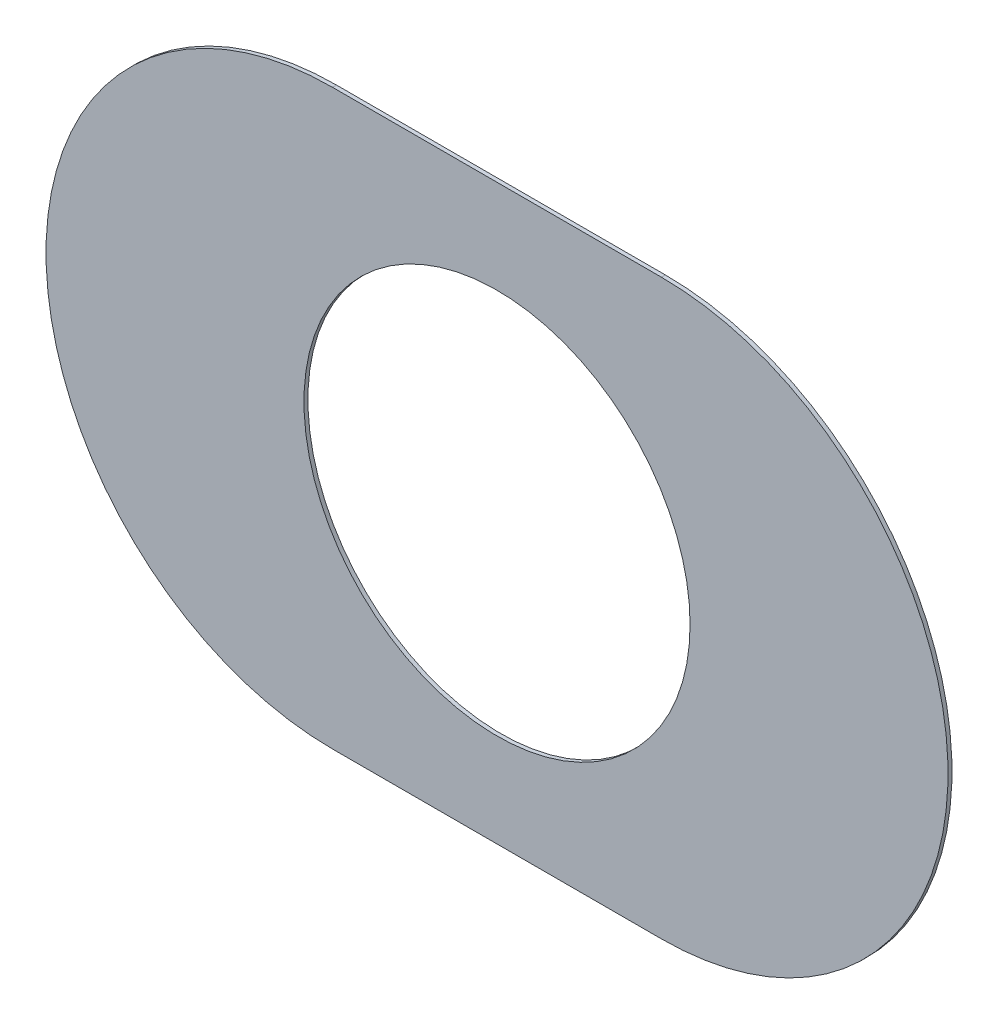
ISO-10303-21;
HEADER;
FILE_DESCRIPTION(('STEP AP214'),'2;1');
FILE_NAME('part.step','',(''),(''),'','','');
FILE_SCHEMA(('AUTOMOTIVE_DESIGN { 1 0 10303 214 1 1 1 1 }'));
ENDSEC;
DATA;
#1=APPLICATION_CONTEXT('core data for automotive mechanical design processes');
#2=APPLICATION_PROTOCOL_DEFINITION('international standard','automotive_design',2000,#1);
#3=PRODUCT_CONTEXT('',#1,'mechanical');
#4=PRODUCT('Part','Part','',(#3));
#5=PRODUCT_RELATED_PRODUCT_CATEGORY('part','',(#4));
#6=PRODUCT_DEFINITION_FORMATION('','',#4);
#7=PRODUCT_DEFINITION_CONTEXT('part definition',#1,'design');
#8=PRODUCT_DEFINITION('design','',#6,#7);
#9=PRODUCT_DEFINITION_SHAPE('','',#8);
#10=(LENGTH_UNIT() NAMED_UNIT(*) SI_UNIT(.MILLI.,.METRE.));
#11=(NAMED_UNIT(*) PLANE_ANGLE_UNIT() SI_UNIT($,.RADIAN.));
#12=(NAMED_UNIT(*) SI_UNIT($,.STERADIAN.) SOLID_ANGLE_UNIT());
#13=UNCERTAINTY_MEASURE_WITH_UNIT(LENGTH_MEASURE(1.E-05),#10,'distance_accuracy_value','');
#14=(GEOMETRIC_REPRESENTATION_CONTEXT(3) GLOBAL_UNCERTAINTY_ASSIGNED_CONTEXT((#13)) GLOBAL_UNIT_ASSIGNED_CONTEXT((#10,
#11,#12)) REPRESENTATION_CONTEXT('',''));
#15=CARTESIAN_POINT('',(0.,0.,0.));
#16=DIRECTION('',(0.,0.,1.));
#17=DIRECTION('',(1.,0.,0.));
#18=AXIS2_PLACEMENT_3D('',#15,#16,#17);
#19=CARTESIAN_POINT('',(24.3000003427268,17.0800006854535,0.));
#20=DIRECTION('',(0.,0.,1.));
#21=DIRECTION('',(1.,0.,0.));
#22=AXIS2_PLACEMENT_3D('',#19,#20,#21);
#23=PLANE('',#22);
#24=CARTESIAN_POINT('',(24.3000003427268,17.0800006854535,0.));
#25=DIRECTION('',(0.,0.,-1.));
#26=DIRECTION('',(-1.,0.,0.));
#27=AXIS2_PLACEMENT_3D('',#24,#25,#26);
#28=CIRCLE('',#27,0.49);
#29=CARTESIAN_POINT('',(24.7900003427268,17.0800006854535,0.));
#30=VERTEX_POINT('',#29);
#31=EDGE_CURVE('E101',#30,#30,#28,.T.);
#32=ORIENTED_EDGE('',*,*,#31,.T.);
#33=EDGE_LOOP('',(#32));
#34=FACE_BOUND('',#33,.T.);
#35=CARTESIAN_POINT('',(23.8825938881802,17.0800006854535,0.));
#36=DIRECTION('',(0.,0.,1.));
#37=DIRECTION('',(0.,1.,0.));
#38=AXIS2_PLACEMENT_3D('',#35,#36,#37);
#39=CIRCLE('',#38,0.727257121659981);
#40=CARTESIAN_POINT('',(23.8825938881802,17.8072578071135,0.));
#41=VERTEX_POINT('',#40);
#42=CARTESIAN_POINT('',(23.8825938881802,16.3527435637935,0.));
#43=VERTEX_POINT('',#42);
#44=EDGE_CURVE('E28',#41,#43,#39,.T.);
#45=ORIENTED_EDGE('',*,*,#44,.T.);
#46=DIRECTION('',(1.,0.,0.));
#47=VECTOR('',#46,1.);
#48=CARTESIAN_POINT('',(23.8825938881802,16.3527435637935,0.));
#49=LINE('',#48,#47);
#50=CARTESIAN_POINT('',(24.7174067972734,16.3527435637935,0.));
#51=VERTEX_POINT('',#50);
#52=EDGE_CURVE('E111',#43,#51,#49,.T.);
#53=ORIENTED_EDGE('',*,*,#52,.T.);
#54=CARTESIAN_POINT('',(24.7174067972734,17.0800006854535,0.));
#55=DIRECTION('',(0.,0.,1.));
#56=DIRECTION('',(0.,-1.,0.));
#57=AXIS2_PLACEMENT_3D('',#54,#55,#56);
#58=CIRCLE('',#57,0.727257121659981);
#59=CARTESIAN_POINT('',(24.7174067972734,17.8072578071135,0.));
#60=VERTEX_POINT('',#59);
#61=EDGE_CURVE('E75',#51,#60,#58,.T.);
#62=ORIENTED_EDGE('',*,*,#61,.T.);
#63=DIRECTION('',(-1.,0.,0.));
#64=VECTOR('',#63,1.);
#65=CARTESIAN_POINT('',(24.7174067972734,17.8072578071135,0.));
#66=LINE('',#65,#64);
#67=EDGE_CURVE('E94',#60,#41,#66,.T.);
#68=ORIENTED_EDGE('',*,*,#67,.T.);
#69=EDGE_LOOP('',(#45,#53,#62,#68));
#70=FACE_BOUND('',#69,.T.);
#71=ADVANCED_FACE('F17',(#34,#70),#23,.T.);
#72=CARTESIAN_POINT('',(24.3000003427268,17.0800006854535,-0.01));
#73=DIRECTION('',(0.,0.,1.));
#74=DIRECTION('',(1.,0.,0.));
#75=AXIS2_PLACEMENT_3D('',#72,#73,#74);
#76=PLANE('',#75);
#77=CARTESIAN_POINT('',(24.3000003427268,17.0800006854535,-0.01));
#78=DIRECTION('',(0.,0.,-1.));
#79=DIRECTION('',(-1.,0.,0.));
#80=AXIS2_PLACEMENT_3D('',#77,#78,#79);
#81=CIRCLE('',#80,0.49);
#82=CARTESIAN_POINT('',(24.7900003427268,17.0800006854535,-0.01));
#83=VERTEX_POINT('',#82);
#84=EDGE_CURVE('E126',#83,#83,#81,.T.);
#85=ORIENTED_EDGE('',*,*,#84,.F.);
#86=EDGE_LOOP('',(#85));
#87=FACE_BOUND('',#86,.T.);
#88=CARTESIAN_POINT('',(23.8825938881802,17.0800006854535,-0.01));
#89=DIRECTION('',(0.,0.,1.));
#90=DIRECTION('',(0.,1.,0.));
#91=AXIS2_PLACEMENT_3D('',#88,#89,#90);
#92=CIRCLE('',#91,0.727257121659981);
#93=CARTESIAN_POINT('',(23.8825938881802,17.8072578071135,-0.01));
#94=VERTEX_POINT('',#93);
#95=CARTESIAN_POINT('',(23.8825938881802,16.3527435637935,-0.01));
#96=VERTEX_POINT('',#95);
#97=EDGE_CURVE('E11',#94,#96,#92,.T.);
#98=ORIENTED_EDGE('',*,*,#97,.F.);
#99=DIRECTION('',(-1.,0.,0.));
#100=VECTOR('',#99,1.);
#101=CARTESIAN_POINT('',(24.7174067972734,17.8072578071135,-0.01));
#102=LINE('',#101,#100);
#103=CARTESIAN_POINT('',(24.7174067972734,17.8072578071135,-0.01));
#104=VERTEX_POINT('',#103);
#105=EDGE_CURVE('E96',#104,#94,#102,.T.);
#106=ORIENTED_EDGE('',*,*,#105,.F.);
#107=CARTESIAN_POINT('',(24.7174067972734,17.0800006854535,-0.01));
#108=DIRECTION('',(0.,0.,1.));
#109=DIRECTION('',(0.,-1.,0.));
#110=AXIS2_PLACEMENT_3D('',#107,#108,#109);
#111=CIRCLE('',#110,0.727257121659981);
#112=CARTESIAN_POINT('',(24.7174067972734,16.3527435637935,-0.01));
#113=VERTEX_POINT('',#112);
#114=EDGE_CURVE('E21',#113,#104,#111,.T.);
#115=ORIENTED_EDGE('',*,*,#114,.F.);
#116=DIRECTION('',(1.,0.,0.));
#117=VECTOR('',#116,1.);
#118=CARTESIAN_POINT('',(23.8825938881802,16.3527435637935,-0.01));
#119=LINE('',#118,#117);
#120=EDGE_CURVE('E88',#96,#113,#119,.T.);
#121=ORIENTED_EDGE('',*,*,#120,.F.);
#122=EDGE_LOOP('',(#98,#106,#115,#121));
#123=FACE_BOUND('',#122,.T.);
#124=ADVANCED_FACE('F147',(#87,#123),#76,.F.);
#125=CARTESIAN_POINT('',(23.8825938881802,17.0800006854535,0.));
#126=DIRECTION('',(0.,0.,1.));
#127=DIRECTION('',(0.,1.,0.));
#128=AXIS2_PLACEMENT_3D('',#125,#126,#127);
#129=CYLINDRICAL_SURFACE('',#128,0.727257121659981);
#130=ORIENTED_EDGE('',*,*,#44,.F.);
#131=DIRECTION('',(0.,0.,-1.));
#132=VECTOR('',#131,1.);
#133=CARTESIAN_POINT('',(23.8825938881802,17.8072578071135,0.));
#134=LINE('',#133,#132);
#135=EDGE_CURVE('E82',#41,#94,#134,.T.);
#136=ORIENTED_EDGE('',*,*,#135,.T.);
#137=ORIENTED_EDGE('',*,*,#97,.T.);
#138=DIRECTION('',(0.,0.,-1.));
#139=VECTOR('',#138,1.);
#140=CARTESIAN_POINT('',(23.8825938881802,16.3527435637935,0.));
#141=LINE('',#140,#139);
#142=EDGE_CURVE('E85',#43,#96,#141,.T.);
#143=ORIENTED_EDGE('',*,*,#142,.F.);
#144=EDGE_LOOP('',(#130,#136,#137,#143));
#145=FACE_BOUND('',#144,.T.);
#146=ADVANCED_FACE('F81',(#145),#129,.T.);
#147=CARTESIAN_POINT('',(23.8825938881802,16.3527435637935,0.));
#148=DIRECTION('',(0.,1.,0.));
#149=DIRECTION('',(1.,0.,0.));
#150=AXIS2_PLACEMENT_3D('',#147,#148,#149);
#151=PLANE('',#150);
#152=ORIENTED_EDGE('',*,*,#52,.F.);
#153=ORIENTED_EDGE('',*,*,#142,.T.);
#154=ORIENTED_EDGE('',*,*,#120,.T.);
#155=DIRECTION('',(0.,0.,-1.));
#156=VECTOR('',#155,1.);
#157=CARTESIAN_POINT('',(24.7174067972734,16.3527435637935,0.));
#158=LINE('',#157,#156);
#159=EDGE_CURVE('E113',#51,#113,#158,.T.);
#160=ORIENTED_EDGE('',*,*,#159,.F.);
#161=EDGE_LOOP('',(#152,#153,#154,#160));
#162=FACE_BOUND('',#161,.T.);
#163=ADVANCED_FACE('F145',(#162),#151,.F.);
#164=CARTESIAN_POINT('',(24.7174067972734,17.0800006854535,0.));
#165=DIRECTION('',(0.,0.,1.));
#166=DIRECTION('',(0.,-1.,0.));
#167=AXIS2_PLACEMENT_3D('',#164,#165,#166);
#168=CYLINDRICAL_SURFACE('',#167,0.727257121659981);
#169=ORIENTED_EDGE('',*,*,#61,.F.);
#170=ORIENTED_EDGE('',*,*,#159,.T.);
#171=ORIENTED_EDGE('',*,*,#114,.T.);
#172=DIRECTION('',(0.,0.,-1.));
#173=VECTOR('',#172,1.);
#174=CARTESIAN_POINT('',(24.7174067972734,17.8072578071135,0.));
#175=LINE('',#174,#173);
#176=EDGE_CURVE('E100',#60,#104,#175,.T.);
#177=ORIENTED_EDGE('',*,*,#176,.F.);
#178=EDGE_LOOP('',(#169,#170,#171,#177));
#179=FACE_BOUND('',#178,.T.);
#180=ADVANCED_FACE('F19',(#179),#168,.T.);
#181=CARTESIAN_POINT('',(24.7174067972734,17.8072578071135,0.));
#182=DIRECTION('',(0.,-1.,0.));
#183=DIRECTION('',(0.,0.,-1.));
#184=AXIS2_PLACEMENT_3D('',#181,#182,#183);
#185=PLANE('',#184);
#186=ORIENTED_EDGE('',*,*,#67,.F.);
#187=ORIENTED_EDGE('',*,*,#176,.T.);
#188=ORIENTED_EDGE('',*,*,#105,.T.);
#189=ORIENTED_EDGE('',*,*,#135,.F.);
#190=EDGE_LOOP('',(#186,#187,#188,#189));
#191=FACE_BOUND('',#190,.T.);
#192=ADVANCED_FACE('F92',(#191),#185,.F.);
#193=CARTESIAN_POINT('',(24.3000003427268,17.0800006854535,0.));
#194=DIRECTION('',(0.,0.,1.));
#195=DIRECTION('',(-1.,0.,0.));
#196=AXIS2_PLACEMENT_3D('',#193,#194,#195);
#197=CYLINDRICAL_SURFACE('',#196,0.49);
#198=ORIENTED_EDGE('',*,*,#84,.T.);
#199=DIRECTION('',(0.,0.,1.));
#200=VECTOR('',#199,1.);
#201=CARTESIAN_POINT('',(24.7900003427268,17.0800006854535,0.));
#202=LINE('',#201,#200);
#203=EDGE_CURVE('E108',#83,#30,#202,.T.);
#204=ORIENTED_EDGE('',*,*,#203,.T.);
#205=ORIENTED_EDGE('',*,*,#31,.F.);
#206=ORIENTED_EDGE('',*,*,#203,.F.);
#207=EDGE_LOOP('',(#198,#204,#205,#206));
#208=FACE_BOUND('',#207,.T.);
#209=ADVANCED_FACE('F164',(#208),#197,.F.);
#210=CLOSED_SHELL('',(#71,#124,#146,#163,#180,#192,#209));
#211=MANIFOLD_SOLID_BREP('B1',#210);
#212=ADVANCED_BREP_SHAPE_REPRESENTATION('',(#18,#211),#14);
#213=SHAPE_DEFINITION_REPRESENTATION(#9,#212);
ENDSEC;
END-ISO-10303-21;
